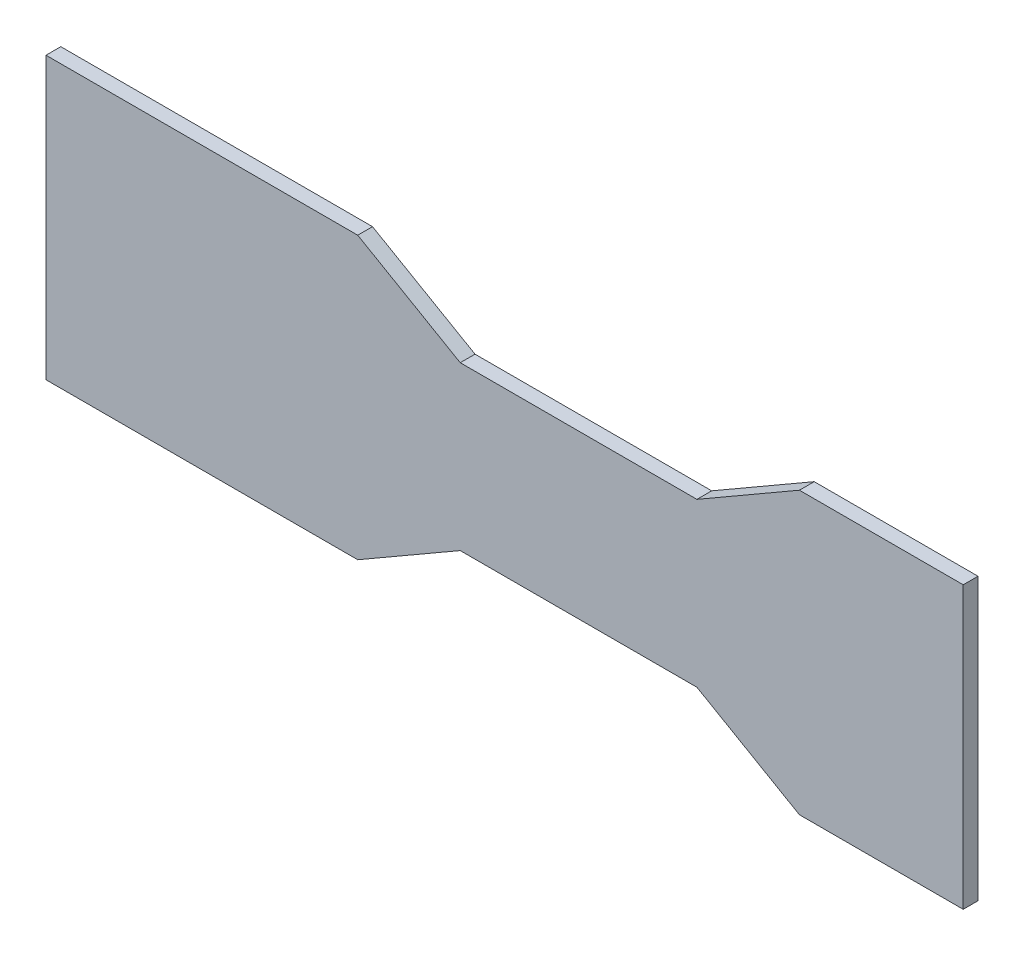
ISO-10303-21;
HEADER;
FILE_DESCRIPTION(('STEP AP214'),'2;1');
FILE_NAME('part.step','',(''),(''),'','','');
FILE_SCHEMA(('AUTOMOTIVE_DESIGN { 1 0 10303 214 1 1 1 1 }'));
ENDSEC;
DATA;
#1=APPLICATION_CONTEXT('core data for automotive mechanical design processes');
#2=APPLICATION_PROTOCOL_DEFINITION('international standard','automotive_design',2000,#1);
#3=PRODUCT_CONTEXT('',#1,'mechanical');
#4=PRODUCT('Part','Part','',(#3));
#5=PRODUCT_RELATED_PRODUCT_CATEGORY('part','',(#4));
#6=PRODUCT_DEFINITION_FORMATION('','',#4);
#7=PRODUCT_DEFINITION_CONTEXT('part definition',#1,'design');
#8=PRODUCT_DEFINITION('design','',#6,#7);
#9=PRODUCT_DEFINITION_SHAPE('','',#8);
#10=(LENGTH_UNIT() NAMED_UNIT(*) SI_UNIT(.MILLI.,.METRE.));
#11=(NAMED_UNIT(*) PLANE_ANGLE_UNIT() SI_UNIT($,.RADIAN.));
#12=(NAMED_UNIT(*) SI_UNIT($,.STERADIAN.) SOLID_ANGLE_UNIT());
#13=UNCERTAINTY_MEASURE_WITH_UNIT(LENGTH_MEASURE(1.E-05),#10,'distance_accuracy_value','');
#14=(GEOMETRIC_REPRESENTATION_CONTEXT(3) GLOBAL_UNCERTAINTY_ASSIGNED_CONTEXT((#13)) GLOBAL_UNIT_ASSIGNED_CONTEXT((#10,
#11,#12)) REPRESENTATION_CONTEXT('',''));
#15=CARTESIAN_POINT('',(0.,0.,0.));
#16=DIRECTION('',(0.,0.,1.));
#17=DIRECTION('',(1.,0.,0.));
#18=AXIS2_PLACEMENT_3D('',#15,#16,#17);
#19=CARTESIAN_POINT('',(0.,0.,6.35));
#20=DIRECTION('',(0.,1.,0.));
#21=DIRECTION('',(0.,0.,1.));
#22=AXIS2_PLACEMENT_3D('',#19,#20,#21);
#23=PLANE('',#22);
#24=DIRECTION('',(1.,0.,0.));
#25=VECTOR('',#24,1.);
#26=CARTESIAN_POINT('',(0.,0.,0.));
#27=LINE('',#26,#25);
#28=CARTESIAN_POINT('',(0.,0.,0.));
#29=VERTEX_POINT('',#28);
#30=CARTESIAN_POINT('',(133.805909487751,0.,0.));
#31=VERTEX_POINT('',#30);
#32=EDGE_CURVE('E146',#29,#31,#27,.T.);
#33=ORIENTED_EDGE('',*,*,#32,.T.);
#34=DIRECTION('',(0.,0.,1.));
#35=VECTOR('',#34,1.);
#36=CARTESIAN_POINT('',(133.805909487751,0.,0.));
#37=LINE('',#36,#35);
#38=CARTESIAN_POINT('',(133.805909487751,0.,6.35));
#39=VERTEX_POINT('',#38);
#40=EDGE_CURVE('E215',#31,#39,#37,.T.);
#41=ORIENTED_EDGE('',*,*,#40,.T.);
#42=DIRECTION('',(1.,0.,0.));
#43=VECTOR('',#42,1.);
#44=CARTESIAN_POINT('',(0.,0.,6.35));
#45=LINE('',#44,#43);
#46=CARTESIAN_POINT('',(0.,0.,6.35));
#47=VERTEX_POINT('',#46);
#48=EDGE_CURVE('E176',#47,#39,#45,.T.);
#49=ORIENTED_EDGE('',*,*,#48,.F.);
#50=DIRECTION('',(0.,0.,-1.));
#51=VECTOR('',#50,1.);
#52=CARTESIAN_POINT('',(0.,0.,6.35));
#53=LINE('',#52,#51);
#54=EDGE_CURVE('E11',#47,#29,#53,.T.);
#55=ORIENTED_EDGE('',*,*,#54,.T.);
#56=EDGE_LOOP('',(#33,#41,#49,#55));
#57=FACE_BOUND('',#56,.T.);
#58=ADVANCED_FACE('F33',(#57),#23,.F.);
#59=CARTESIAN_POINT('',(0.,120.65,6.35));
#60=DIRECTION('',(0.,-1.,0.));
#61=DIRECTION('',(0.,0.,-1.));
#62=AXIS2_PLACEMENT_3D('',#59,#60,#61);
#63=PLANE('',#62);
#64=DIRECTION('',(-1.,0.,0.));
#65=VECTOR('',#64,1.);
#66=CARTESIAN_POINT('',(0.,120.65,0.));
#67=LINE('',#66,#65);
#68=CARTESIAN_POINT('',(393.7,120.65,0.));
#69=VERTEX_POINT('',#68);
#70=CARTESIAN_POINT('',(323.394090512249,120.65,0.));
#71=VERTEX_POINT('',#70);
#72=EDGE_CURVE('E157',#69,#71,#67,.T.);
#73=ORIENTED_EDGE('',*,*,#72,.T.);
#74=DIRECTION('',(0.,0.,1.));
#75=VECTOR('',#74,1.);
#76=CARTESIAN_POINT('',(323.394090512249,120.65,0.));
#77=LINE('',#76,#75);
#78=CARTESIAN_POINT('',(323.394090512249,120.65,6.35));
#79=VERTEX_POINT('',#78);
#80=EDGE_CURVE('E151',#71,#79,#77,.T.);
#81=ORIENTED_EDGE('',*,*,#80,.T.);
#82=DIRECTION('',(-1.,0.,0.));
#83=VECTOR('',#82,1.);
#84=CARTESIAN_POINT('',(0.,120.65,6.35));
#85=LINE('',#84,#83);
#86=CARTESIAN_POINT('',(393.7,120.65,6.35));
#87=VERTEX_POINT('',#86);
#88=EDGE_CURVE('E165',#87,#79,#85,.T.);
#89=ORIENTED_EDGE('',*,*,#88,.F.);
#90=DIRECTION('',(0.,0.,-1.));
#91=VECTOR('',#90,1.);
#92=CARTESIAN_POINT('',(393.7,120.65,6.35));
#93=LINE('',#92,#91);
#94=EDGE_CURVE('E164',#87,#69,#93,.T.);
#95=ORIENTED_EDGE('',*,*,#94,.T.);
#96=EDGE_LOOP('',(#73,#81,#89,#95));
#97=FACE_BOUND('',#96,.T.);
#98=ADVANCED_FACE('F187',(#97),#63,.F.);
#99=CARTESIAN_POINT('',(0.,0.,6.35));
#100=DIRECTION('',(1.,0.,0.));
#101=DIRECTION('',(0.,0.,-1.));
#102=AXIS2_PLACEMENT_3D('',#99,#100,#101);
#103=PLANE('',#102);
#104=DIRECTION('',(0.,-1.,0.));
#105=VECTOR('',#104,1.);
#106=CARTESIAN_POINT('',(0.,0.,0.));
#107=LINE('',#106,#105);
#108=CARTESIAN_POINT('',(0.,120.65,0.));
#109=VERTEX_POINT('',#108);
#110=EDGE_CURVE('E147',#109,#29,#107,.T.);
#111=ORIENTED_EDGE('',*,*,#110,.T.);
#112=ORIENTED_EDGE('',*,*,#54,.F.);
#113=DIRECTION('',(0.,-1.,0.));
#114=VECTOR('',#113,1.);
#115=CARTESIAN_POINT('',(0.,0.,6.35));
#116=LINE('',#115,#114);
#117=CARTESIAN_POINT('',(0.,120.65,6.35));
#118=VERTEX_POINT('',#117);
#119=EDGE_CURVE('E160',#118,#47,#116,.T.);
#120=ORIENTED_EDGE('',*,*,#119,.F.);
#121=DIRECTION('',(0.,0.,-1.));
#122=VECTOR('',#121,1.);
#123=CARTESIAN_POINT('',(0.,120.65,6.35));
#124=LINE('',#123,#122);
#125=EDGE_CURVE('E161',#118,#109,#124,.T.);
#126=ORIENTED_EDGE('',*,*,#125,.T.);
#127=EDGE_LOOP('',(#111,#112,#120,#126));
#128=FACE_BOUND('',#127,.T.);
#129=ADVANCED_FACE('F35',(#128),#103,.F.);
#130=CARTESIAN_POINT('',(323.394090512249,0.,6.35));
#131=VERTEX_POINT('',#130);
#132=CARTESIAN_POINT('',(393.7,0.,6.35));
#133=VERTEX_POINT('',#132);
#134=EDGE_CURVE('E138',#131,#133,#45,.T.);
#135=ORIENTED_EDGE('',*,*,#134,.F.);
#136=DIRECTION('',(0.,0.,1.));
#137=VECTOR('',#136,1.);
#138=CARTESIAN_POINT('',(323.394090512249,0.,0.));
#139=LINE('',#138,#137);
#140=CARTESIAN_POINT('',(323.394090512249,0.,0.));
#141=VERTEX_POINT('',#140);
#142=EDGE_CURVE('E125',#141,#131,#139,.T.);
#143=ORIENTED_EDGE('',*,*,#142,.F.);
#144=CARTESIAN_POINT('',(393.7,0.,0.));
#145=VERTEX_POINT('',#144);
#146=EDGE_CURVE('E136',#141,#145,#27,.T.);
#147=ORIENTED_EDGE('',*,*,#146,.T.);
#148=DIRECTION('',(0.,0.,-1.));
#149=VECTOR('',#148,1.);
#150=CARTESIAN_POINT('',(393.7,0.,6.35));
#151=LINE('',#150,#149);
#152=EDGE_CURVE('E41',#133,#145,#151,.T.);
#153=ORIENTED_EDGE('',*,*,#152,.F.);
#154=EDGE_LOOP('',(#135,#143,#147,#153));
#155=FACE_BOUND('',#154,.T.);
#156=ADVANCED_FACE('F134',(#155),#23,.F.);
#157=CARTESIAN_POINT('',(393.7,0.,6.35));
#158=DIRECTION('',(-1.,0.,0.));
#159=DIRECTION('',(0.,0.,1.));
#160=AXIS2_PLACEMENT_3D('',#157,#158,#159);
#161=PLANE('',#160);
#162=DIRECTION('',(0.,1.,0.));
#163=VECTOR('',#162,1.);
#164=CARTESIAN_POINT('',(393.7,0.,0.));
#165=LINE('',#164,#163);
#166=EDGE_CURVE('E145',#145,#69,#165,.T.);
#167=ORIENTED_EDGE('',*,*,#166,.T.);
#168=ORIENTED_EDGE('',*,*,#94,.F.);
#169=DIRECTION('',(0.,1.,0.));
#170=VECTOR('',#169,1.);
#171=CARTESIAN_POINT('',(393.7,0.,6.35));
#172=LINE('',#171,#170);
#173=EDGE_CURVE('E171',#133,#87,#172,.T.);
#174=ORIENTED_EDGE('',*,*,#173,.F.);
#175=ORIENTED_EDGE('',*,*,#152,.T.);
#176=EDGE_LOOP('',(#167,#168,#174,#175));
#177=FACE_BOUND('',#176,.T.);
#178=ADVANCED_FACE('F169',(#177),#161,.F.);
#179=CARTESIAN_POINT('',(133.805909487751,120.65,6.35));
#180=VERTEX_POINT('',#179);
#181=EDGE_CURVE('E175',#180,#118,#85,.T.);
#182=ORIENTED_EDGE('',*,*,#181,.F.);
#183=DIRECTION('',(0.,0.,1.));
#184=VECTOR('',#183,1.);
#185=CARTESIAN_POINT('',(133.805909487751,120.65,0.));
#186=LINE('',#185,#184);
#187=CARTESIAN_POINT('',(133.805909487751,120.65,0.));
#188=VERTEX_POINT('',#187);
#189=EDGE_CURVE('E199',#188,#180,#186,.T.);
#190=ORIENTED_EDGE('',*,*,#189,.F.);
#191=EDGE_CURVE('E156',#188,#109,#67,.T.);
#192=ORIENTED_EDGE('',*,*,#191,.T.);
#193=ORIENTED_EDGE('',*,*,#125,.F.);
#194=EDGE_LOOP('',(#182,#190,#192,#193));
#195=FACE_BOUND('',#194,.T.);
#196=ADVANCED_FACE('F250',(#195),#63,.F.);
#197=CARTESIAN_POINT('',(0.,0.,6.35));
#198=DIRECTION('',(0.,0.,-1.));
#199=DIRECTION('',(-1.,0.,0.));
#200=AXIS2_PLACEMENT_3D('',#197,#198,#199);
#201=PLANE('',#200);
#202=ORIENTED_EDGE('',*,*,#48,.T.);
#203=DIRECTION('',(-0.866025403784438,-0.500000000000002,0.));
#204=VECTOR('',#203,1.);
#205=CARTESIAN_POINT('',(133.805909487751,0.,6.35));
#206=LINE('',#205,#204);
#207=CARTESIAN_POINT('',(177.8,25.4,6.35));
#208=VERTEX_POINT('',#207);
#209=EDGE_CURVE('E130',#208,#39,#206,.T.);
#210=ORIENTED_EDGE('',*,*,#209,.F.);
#211=DIRECTION('',(-1.,0.,0.));
#212=VECTOR('',#211,1.);
#213=CARTESIAN_POINT('',(177.8,25.4,6.35));
#214=LINE('',#213,#212);
#215=CARTESIAN_POINT('',(279.4,25.4,6.35));
#216=VERTEX_POINT('',#215);
#217=EDGE_CURVE('E208',#216,#208,#214,.T.);
#218=ORIENTED_EDGE('',*,*,#217,.F.);
#219=DIRECTION('',(-0.866025403784438,0.500000000000001,0.));
#220=VECTOR('',#219,1.);
#221=CARTESIAN_POINT('',(279.4,25.4,6.35));
#222=LINE('',#221,#220);
#223=EDGE_CURVE('E205',#131,#216,#222,.T.);
#224=ORIENTED_EDGE('',*,*,#223,.F.);
#225=ORIENTED_EDGE('',*,*,#134,.T.);
#226=ORIENTED_EDGE('',*,*,#173,.T.);
#227=ORIENTED_EDGE('',*,*,#88,.T.);
#228=DIRECTION('',(0.866025403784438,0.500000000000001,0.));
#229=VECTOR('',#228,1.);
#230=CARTESIAN_POINT('',(279.4,95.25,6.35));
#231=LINE('',#230,#229);
#232=CARTESIAN_POINT('',(279.4,95.25,6.35));
#233=VERTEX_POINT('',#232);
#234=EDGE_CURVE('E184',#233,#79,#231,.T.);
#235=ORIENTED_EDGE('',*,*,#234,.F.);
#236=DIRECTION('',(1.,0.,0.));
#237=VECTOR('',#236,1.);
#238=CARTESIAN_POINT('',(177.8,95.25,6.35));
#239=LINE('',#238,#237);
#240=CARTESIAN_POINT('',(177.8,95.25,6.35));
#241=VERTEX_POINT('',#240);
#242=EDGE_CURVE('E228',#241,#233,#239,.T.);
#243=ORIENTED_EDGE('',*,*,#242,.F.);
#244=DIRECTION('',(0.866025403784438,-0.500000000000001,0.));
#245=VECTOR('',#244,1.);
#246=CARTESIAN_POINT('',(133.805909487751,120.65,6.35));
#247=LINE('',#246,#245);
#248=EDGE_CURVE('E218',#180,#241,#247,.T.);
#249=ORIENTED_EDGE('',*,*,#248,.F.);
#250=ORIENTED_EDGE('',*,*,#181,.T.);
#251=ORIENTED_EDGE('',*,*,#119,.T.);
#252=EDGE_LOOP('',(#202,#210,#218,#224,#225,#226,#227,#235,#243,#249,#250,#251));
#253=FACE_BOUND('',#252,.T.);
#254=ADVANCED_FACE('F182',(#253),#201,.F.);
#255=CARTESIAN_POINT('',(0.,0.,0.));
#256=DIRECTION('',(0.,0.,-1.));
#257=DIRECTION('',(-1.,0.,0.));
#258=AXIS2_PLACEMENT_3D('',#255,#256,#257);
#259=PLANE('',#258);
#260=DIRECTION('',(-0.866025403784438,-0.500000000000002,0.));
#261=VECTOR('',#260,1.);
#262=CARTESIAN_POINT('',(133.805909487751,0.,0.));
#263=LINE('',#262,#261);
#264=CARTESIAN_POINT('',(177.8,25.4,0.));
#265=VERTEX_POINT('',#264);
#266=EDGE_CURVE('E139',#265,#31,#263,.T.);
#267=ORIENTED_EDGE('',*,*,#266,.T.);
#268=ORIENTED_EDGE('',*,*,#32,.F.);
#269=ORIENTED_EDGE('',*,*,#110,.F.);
#270=ORIENTED_EDGE('',*,*,#191,.F.);
#271=DIRECTION('',(0.866025403784438,-0.500000000000001,0.));
#272=VECTOR('',#271,1.);
#273=CARTESIAN_POINT('',(133.805909487751,120.65,0.));
#274=LINE('',#273,#272);
#275=CARTESIAN_POINT('',(177.8,95.25,0.));
#276=VERTEX_POINT('',#275);
#277=EDGE_CURVE('E222',#188,#276,#274,.T.);
#278=ORIENTED_EDGE('',*,*,#277,.T.);
#279=DIRECTION('',(1.,0.,0.));
#280=VECTOR('',#279,1.);
#281=CARTESIAN_POINT('',(177.8,95.25,0.));
#282=LINE('',#281,#280);
#283=CARTESIAN_POINT('',(279.4,95.25,0.));
#284=VERTEX_POINT('',#283);
#285=EDGE_CURVE('E56',#276,#284,#282,.T.);
#286=ORIENTED_EDGE('',*,*,#285,.T.);
#287=DIRECTION('',(0.866025403784438,0.500000000000001,0.));
#288=VECTOR('',#287,1.);
#289=CARTESIAN_POINT('',(279.4,95.25,0.));
#290=LINE('',#289,#288);
#291=EDGE_CURVE('E200',#284,#71,#290,.T.);
#292=ORIENTED_EDGE('',*,*,#291,.T.);
#293=ORIENTED_EDGE('',*,*,#72,.F.);
#294=ORIENTED_EDGE('',*,*,#166,.F.);
#295=ORIENTED_EDGE('',*,*,#146,.F.);
#296=DIRECTION('',(-0.866025403784438,0.500000000000001,0.));
#297=VECTOR('',#296,1.);
#298=CARTESIAN_POINT('',(279.4,25.4,0.));
#299=LINE('',#298,#297);
#300=CARTESIAN_POINT('',(279.4,25.4,0.));
#301=VERTEX_POINT('',#300);
#302=EDGE_CURVE('E121',#141,#301,#299,.T.);
#303=ORIENTED_EDGE('',*,*,#302,.T.);
#304=DIRECTION('',(-1.,0.,0.));
#305=VECTOR('',#304,1.);
#306=CARTESIAN_POINT('',(177.8,25.4,0.));
#307=LINE('',#306,#305);
#308=EDGE_CURVE('E48',#301,#265,#307,.T.);
#309=ORIENTED_EDGE('',*,*,#308,.T.);
#310=EDGE_LOOP('',(#267,#268,#269,#270,#278,#286,#292,#293,#294,#295,#303,#309));
#311=FACE_BOUND('',#310,.T.);
#312=ADVANCED_FACE('F143',(#311),#259,.T.);
#313=CARTESIAN_POINT('',(279.4,95.25,0.));
#314=DIRECTION('',(0.500000000000001,-0.866025403784438,0.));
#315=DIRECTION('',(0.866025403784438,0.500000000000001,0.));
#316=AXIS2_PLACEMENT_3D('',#313,#314,#315);
#317=PLANE('',#316);
#318=ORIENTED_EDGE('',*,*,#234,.T.);
#319=ORIENTED_EDGE('',*,*,#80,.F.);
#320=ORIENTED_EDGE('',*,*,#291,.F.);
#321=DIRECTION('',(0.,0.,1.));
#322=VECTOR('',#321,1.);
#323=CARTESIAN_POINT('',(279.4,95.25,0.));
#324=LINE('',#323,#322);
#325=EDGE_CURVE('E191',#284,#233,#324,.T.);
#326=ORIENTED_EDGE('',*,*,#325,.T.);
#327=EDGE_LOOP('',(#318,#319,#320,#326));
#328=FACE_BOUND('',#327,.T.);
#329=ADVANCED_FACE('F230',(#328),#317,.F.);
#330=CARTESIAN_POINT('',(177.8,95.25,0.));
#331=DIRECTION('',(0.,-1.,0.));
#332=DIRECTION('',(0.,0.,-1.));
#333=AXIS2_PLACEMENT_3D('',#330,#331,#332);
#334=PLANE('',#333);
#335=ORIENTED_EDGE('',*,*,#242,.T.);
#336=ORIENTED_EDGE('',*,*,#325,.F.);
#337=ORIENTED_EDGE('',*,*,#285,.F.);
#338=DIRECTION('',(0.,0.,1.));
#339=VECTOR('',#338,1.);
#340=CARTESIAN_POINT('',(177.8,95.25,0.));
#341=LINE('',#340,#339);
#342=EDGE_CURVE('E193',#276,#241,#341,.T.);
#343=ORIENTED_EDGE('',*,*,#342,.T.);
#344=EDGE_LOOP('',(#335,#336,#337,#343));
#345=FACE_BOUND('',#344,.T.);
#346=ADVANCED_FACE('F231',(#345),#334,.F.);
#347=CARTESIAN_POINT('',(133.805909487751,120.65,0.));
#348=DIRECTION('',(-0.500000000000001,-0.866025403784438,0.));
#349=DIRECTION('',(0.866025403784438,-0.500000000000001,0.));
#350=AXIS2_PLACEMENT_3D('',#347,#348,#349);
#351=PLANE('',#350);
#352=ORIENTED_EDGE('',*,*,#248,.T.);
#353=ORIENTED_EDGE('',*,*,#342,.F.);
#354=ORIENTED_EDGE('',*,*,#277,.F.);
#355=ORIENTED_EDGE('',*,*,#189,.T.);
#356=EDGE_LOOP('',(#352,#353,#354,#355));
#357=FACE_BOUND('',#356,.T.);
#358=ADVANCED_FACE('F233',(#357),#351,.F.);
#359=CARTESIAN_POINT('',(133.805909487751,0.,0.));
#360=DIRECTION('',(-0.500000000000001,0.866025403784438,0.));
#361=DIRECTION('',(-0.866025403784438,-0.500000000000002,0.));
#362=AXIS2_PLACEMENT_3D('',#359,#360,#361);
#363=PLANE('',#362);
#364=ORIENTED_EDGE('',*,*,#209,.T.);
#365=ORIENTED_EDGE('',*,*,#40,.F.);
#366=ORIENTED_EDGE('',*,*,#266,.F.);
#367=DIRECTION('',(0.,0.,1.));
#368=VECTOR('',#367,1.);
#369=CARTESIAN_POINT('',(177.8,25.4,0.));
#370=LINE('',#369,#368);
#371=EDGE_CURVE('E219',#265,#208,#370,.T.);
#372=ORIENTED_EDGE('',*,*,#371,.T.);
#373=EDGE_LOOP('',(#364,#365,#366,#372));
#374=FACE_BOUND('',#373,.T.);
#375=ADVANCED_FACE('F239',(#374),#363,.F.);
#376=CARTESIAN_POINT('',(177.8,25.4,0.));
#377=DIRECTION('',(0.,1.,0.));
#378=DIRECTION('',(0.,0.,1.));
#379=AXIS2_PLACEMENT_3D('',#376,#377,#378);
#380=PLANE('',#379);
#381=ORIENTED_EDGE('',*,*,#217,.T.);
#382=ORIENTED_EDGE('',*,*,#371,.F.);
#383=ORIENTED_EDGE('',*,*,#308,.F.);
#384=DIRECTION('',(0.,0.,1.));
#385=VECTOR('',#384,1.);
#386=CARTESIAN_POINT('',(279.4,25.4,0.));
#387=LINE('',#386,#385);
#388=EDGE_CURVE('E127',#301,#216,#387,.T.);
#389=ORIENTED_EDGE('',*,*,#388,.T.);
#390=EDGE_LOOP('',(#381,#382,#383,#389));
#391=FACE_BOUND('',#390,.T.);
#392=ADVANCED_FACE('F266',(#391),#380,.F.);
#393=CARTESIAN_POINT('',(279.4,25.4,0.));
#394=DIRECTION('',(0.500000000000001,0.866025403784438,0.));
#395=DIRECTION('',(-0.866025403784438,0.500000000000001,0.));
#396=AXIS2_PLACEMENT_3D('',#393,#394,#395);
#397=PLANE('',#396);
#398=ORIENTED_EDGE('',*,*,#223,.T.);
#399=ORIENTED_EDGE('',*,*,#388,.F.);
#400=ORIENTED_EDGE('',*,*,#302,.F.);
#401=ORIENTED_EDGE('',*,*,#142,.T.);
#402=EDGE_LOOP('',(#398,#399,#400,#401));
#403=FACE_BOUND('',#402,.T.);
#404=ADVANCED_FACE('F124',(#403),#397,.F.);
#405=CLOSED_SHELL('',(#58,#98,#129,#156,#178,#196,#254,#312,#329,#346,#358,#375,#392,#404));
#406=MANIFOLD_SOLID_BREP('B2',#405);
#407=ADVANCED_BREP_SHAPE_REPRESENTATION('',(#18,#406),#14);
#408=SHAPE_DEFINITION_REPRESENTATION(#9,#407);
ENDSEC;
END-ISO-10303-21;
